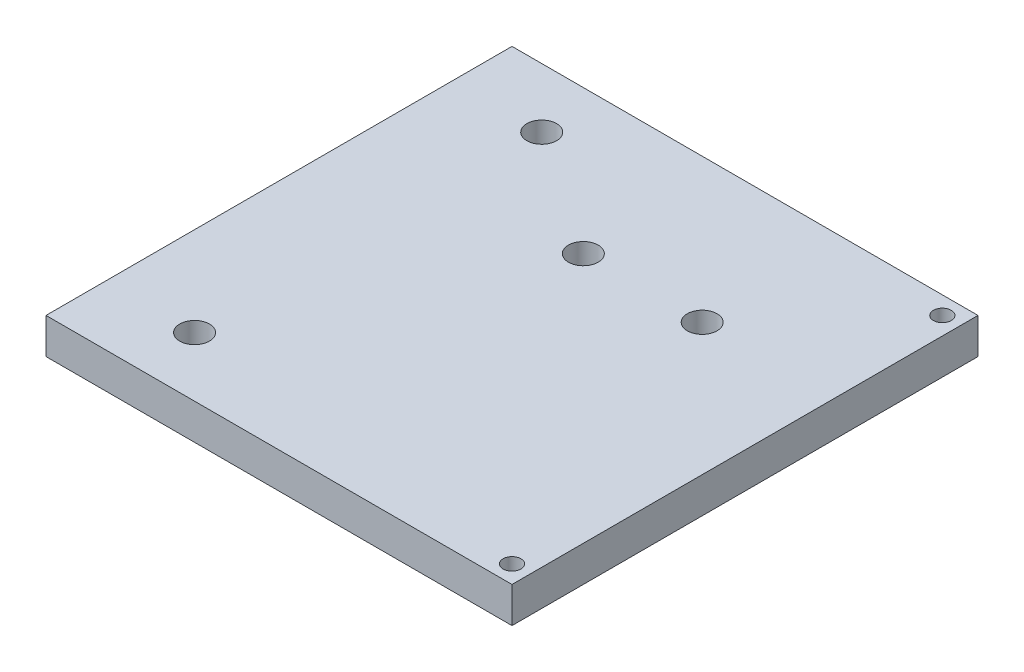
ISO-10303-21;
HEADER;
FILE_DESCRIPTION(('STEP AP214'),'2;1');
FILE_NAME('part.step','',(''),(''),'','','');
FILE_SCHEMA(('AUTOMOTIVE_DESIGN { 1 0 10303 214 1 1 1 1 }'));
ENDSEC;
DATA;
#1=APPLICATION_CONTEXT('core data for automotive mechanical design processes');
#2=APPLICATION_PROTOCOL_DEFINITION('international standard','automotive_design',2000,#1);
#3=PRODUCT_CONTEXT('',#1,'mechanical');
#4=PRODUCT('Part','Part','',(#3));
#5=PRODUCT_RELATED_PRODUCT_CATEGORY('part','',(#4));
#6=PRODUCT_DEFINITION_FORMATION('','',#4);
#7=PRODUCT_DEFINITION_CONTEXT('part definition',#1,'design');
#8=PRODUCT_DEFINITION('design','',#6,#7);
#9=PRODUCT_DEFINITION_SHAPE('','',#8);
#10=(LENGTH_UNIT() NAMED_UNIT(*) SI_UNIT(.MILLI.,.METRE.));
#11=(NAMED_UNIT(*) PLANE_ANGLE_UNIT() SI_UNIT($,.RADIAN.));
#12=(NAMED_UNIT(*) SI_UNIT($,.STERADIAN.) SOLID_ANGLE_UNIT());
#13=UNCERTAINTY_MEASURE_WITH_UNIT(LENGTH_MEASURE(1.E-05),#10,'distance_accuracy_value','');
#14=(GEOMETRIC_REPRESENTATION_CONTEXT(3) GLOBAL_UNCERTAINTY_ASSIGNED_CONTEXT((#13)) GLOBAL_UNIT_ASSIGNED_CONTEXT((#10,
#11,#12)) REPRESENTATION_CONTEXT('',''));
#15=CARTESIAN_POINT('',(0.,0.,0.));
#16=DIRECTION('',(0.,0.,1.));
#17=DIRECTION('',(1.,0.,0.));
#18=AXIS2_PLACEMENT_3D('',#15,#16,#17);
#19=CARTESIAN_POINT('',(0.,6.,0.));
#20=DIRECTION('',(0.,-1.,0.));
#21=DIRECTION('',(0.,0.,-1.));
#22=AXIS2_PLACEMENT_3D('',#19,#20,#21);
#23=PLANE('',#22);
#24=DIRECTION('',(0.,0.,-1.));
#25=VECTOR('',#24,1.);
#26=CARTESIAN_POINT('',(39.2,6.,39.2));
#27=LINE('',#26,#25);
#28=CARTESIAN_POINT('',(39.2,6.,39.2));
#29=VERTEX_POINT('',#28);
#30=CARTESIAN_POINT('',(39.2,6.,-39.2));
#31=VERTEX_POINT('',#30);
#32=EDGE_CURVE('E86',#29,#31,#27,.T.);
#33=ORIENTED_EDGE('',*,*,#32,.T.);
#34=DIRECTION('',(-1.,0.,0.));
#35=VECTOR('',#34,1.);
#36=CARTESIAN_POINT('',(-39.2,6.,-39.2));
#37=LINE('',#36,#35);
#38=CARTESIAN_POINT('',(-39.2,6.,-39.2));
#39=VERTEX_POINT('',#38);
#40=EDGE_CURVE('E81',#31,#39,#37,.T.);
#41=ORIENTED_EDGE('',*,*,#40,.T.);
#42=DIRECTION('',(0.,0.,1.));
#43=VECTOR('',#42,1.);
#44=CARTESIAN_POINT('',(-39.2,6.,39.2));
#45=LINE('',#44,#43);
#46=CARTESIAN_POINT('',(-39.2,6.,39.2));
#47=VERTEX_POINT('',#46);
#48=EDGE_CURVE('E84',#39,#47,#45,.T.);
#49=ORIENTED_EDGE('',*,*,#48,.T.);
#50=DIRECTION('',(1.,0.,0.));
#51=VECTOR('',#50,1.);
#52=CARTESIAN_POINT('',(-39.2,6.,39.2));
#53=LINE('',#52,#51);
#54=EDGE_CURVE('E51',#47,#29,#53,.T.);
#55=ORIENTED_EDGE('',*,*,#54,.T.);
#56=EDGE_LOOP('',(#33,#41,#49,#55));
#57=FACE_BOUND('',#56,.T.);
#58=CARTESIAN_POINT('',(-24.2,6.,-29.2));
#59=DIRECTION('',(0.,1.,0.));
#60=DIRECTION('',(0.,0.,1.));
#61=AXIS2_PLACEMENT_3D('',#58,#59,#60);
#62=CIRCLE('',#61,2.5);
#63=CARTESIAN_POINT('',(-24.2,6.,-26.7));
#64=VERTEX_POINT('',#63);
#65=EDGE_CURVE('E101',#64,#64,#62,.T.);
#66=ORIENTED_EDGE('',*,*,#65,.F.);
#67=EDGE_LOOP('',(#66));
#68=FACE_BOUND('',#67,.T.);
#69=CARTESIAN_POINT('',(-24.2,6.,29.2));
#70=DIRECTION('',(0.,1.,0.));
#71=DIRECTION('',(0.,0.,1.));
#72=AXIS2_PLACEMENT_3D('',#69,#70,#71);
#73=CIRCLE('',#72,2.5);
#74=CARTESIAN_POINT('',(-24.2,6.,31.7));
#75=VERTEX_POINT('',#74);
#76=EDGE_CURVE('E116',#75,#75,#73,.T.);
#77=ORIENTED_EDGE('',*,*,#76,.F.);
#78=EDGE_LOOP('',(#77));
#79=FACE_BOUND('',#78,.T.);
#80=CARTESIAN_POINT('',(36.2,6.,-36.2));
#81=DIRECTION('',(0.,1.,0.));
#82=DIRECTION('',(0.,0.,1.));
#83=AXIS2_PLACEMENT_3D('',#80,#81,#82);
#84=CIRCLE('',#83,1.5);
#85=CARTESIAN_POINT('',(36.2,6.,-34.7));
#86=VERTEX_POINT('',#85);
#87=EDGE_CURVE('E122',#86,#86,#84,.T.);
#88=ORIENTED_EDGE('',*,*,#87,.F.);
#89=EDGE_LOOP('',(#88));
#90=FACE_BOUND('',#89,.T.);
#91=CARTESIAN_POINT('',(36.2,6.,36.2));
#92=DIRECTION('',(0.,1.,0.));
#93=DIRECTION('',(0.,0.,1.));
#94=AXIS2_PLACEMENT_3D('',#91,#92,#93);
#95=CIRCLE('',#94,1.5);
#96=CARTESIAN_POINT('',(36.2,6.,37.7));
#97=VERTEX_POINT('',#96);
#98=EDGE_CURVE('E128',#97,#97,#95,.T.);
#99=ORIENTED_EDGE('',*,*,#98,.F.);
#100=EDGE_LOOP('',(#99));
#101=FACE_BOUND('',#100,.T.);
#102=CARTESIAN_POINT('',(-3.,6.,-15.));
#103=DIRECTION('',(0.,1.,0.));
#104=DIRECTION('',(0.,0.,1.));
#105=AXIS2_PLACEMENT_3D('',#102,#103,#104);
#106=CIRCLE('',#105,2.5);
#107=CARTESIAN_POINT('',(-3.,6.,-12.5));
#108=VERTEX_POINT('',#107);
#109=EDGE_CURVE('E134',#108,#108,#106,.T.);
#110=ORIENTED_EDGE('',*,*,#109,.F.);
#111=EDGE_LOOP('',(#110));
#112=FACE_BOUND('',#111,.T.);
#113=CARTESIAN_POINT('',(17.,6.,-15.));
#114=DIRECTION('',(0.,1.,0.));
#115=DIRECTION('',(0.,0.,1.));
#116=AXIS2_PLACEMENT_3D('',#113,#114,#115);
#117=CIRCLE('',#116,2.5);
#118=CARTESIAN_POINT('',(17.,6.,-12.5));
#119=VERTEX_POINT('',#118);
#120=EDGE_CURVE('E140',#119,#119,#117,.T.);
#121=ORIENTED_EDGE('',*,*,#120,.F.);
#122=EDGE_LOOP('',(#121));
#123=FACE_BOUND('',#122,.T.);
#124=ADVANCED_FACE('F34',(#57,#68,#79,#90,#101,#112,#123),#23,.F.);
#125=CARTESIAN_POINT('',(0.,0.,0.));
#126=DIRECTION('',(0.,-1.,0.));
#127=DIRECTION('',(0.,0.,-1.));
#128=AXIS2_PLACEMENT_3D('',#125,#126,#127);
#129=PLANE('',#128);
#130=CARTESIAN_POINT('',(-3.,0.,-15.));
#131=DIRECTION('',(0.,1.,0.));
#132=DIRECTION('',(0.,0.,1.));
#133=AXIS2_PLACEMENT_3D('',#130,#131,#132);
#134=CIRCLE('',#133,2.5);
#135=CARTESIAN_POINT('',(-3.,0.,-12.5));
#136=VERTEX_POINT('',#135);
#137=EDGE_CURVE('E137',#136,#136,#134,.T.);
#138=ORIENTED_EDGE('',*,*,#137,.T.);
#139=EDGE_LOOP('',(#138));
#140=FACE_BOUND('',#139,.T.);
#141=CARTESIAN_POINT('',(36.2,0.,-36.2));
#142=DIRECTION('',(0.,1.,0.));
#143=DIRECTION('',(0.,0.,1.));
#144=AXIS2_PLACEMENT_3D('',#141,#142,#143);
#145=CIRCLE('',#144,1.5);
#146=CARTESIAN_POINT('',(36.2,0.,-34.7));
#147=VERTEX_POINT('',#146);
#148=EDGE_CURVE('E125',#147,#147,#145,.T.);
#149=ORIENTED_EDGE('',*,*,#148,.T.);
#150=EDGE_LOOP('',(#149));
#151=FACE_BOUND('',#150,.T.);
#152=CARTESIAN_POINT('',(-24.2,0.,-29.2));
#153=DIRECTION('',(0.,1.,0.));
#154=DIRECTION('',(0.,0.,1.));
#155=AXIS2_PLACEMENT_3D('',#152,#153,#154);
#156=CIRCLE('',#155,2.5);
#157=CARTESIAN_POINT('',(-24.2,0.,-26.7));
#158=VERTEX_POINT('',#157);
#159=EDGE_CURVE('E113',#158,#158,#156,.T.);
#160=ORIENTED_EDGE('',*,*,#159,.T.);
#161=EDGE_LOOP('',(#160));
#162=FACE_BOUND('',#161,.T.);
#163=DIRECTION('',(0.,0.,-1.));
#164=VECTOR('',#163,1.);
#165=CARTESIAN_POINT('',(39.2,0.,39.2));
#166=LINE('',#165,#164);
#167=CARTESIAN_POINT('',(39.2,0.,39.2));
#168=VERTEX_POINT('',#167);
#169=CARTESIAN_POINT('',(39.2,0.,-39.2));
#170=VERTEX_POINT('',#169);
#171=EDGE_CURVE('E98',#168,#170,#166,.T.);
#172=ORIENTED_EDGE('',*,*,#171,.F.);
#173=DIRECTION('',(1.,0.,0.));
#174=VECTOR('',#173,1.);
#175=CARTESIAN_POINT('',(-39.2,0.,39.2));
#176=LINE('',#175,#174);
#177=CARTESIAN_POINT('',(-39.2,0.,39.2));
#178=VERTEX_POINT('',#177);
#179=EDGE_CURVE('E74',#178,#168,#176,.T.);
#180=ORIENTED_EDGE('',*,*,#179,.F.);
#181=DIRECTION('',(0.,0.,1.));
#182=VECTOR('',#181,1.);
#183=CARTESIAN_POINT('',(-39.2,0.,39.2));
#184=LINE('',#183,#182);
#185=CARTESIAN_POINT('',(-39.2,0.,-39.2));
#186=VERTEX_POINT('',#185);
#187=EDGE_CURVE('E68',#186,#178,#184,.T.);
#188=ORIENTED_EDGE('',*,*,#187,.F.);
#189=DIRECTION('',(-1.,0.,0.));
#190=VECTOR('',#189,1.);
#191=CARTESIAN_POINT('',(-39.2,0.,-39.2));
#192=LINE('',#191,#190);
#193=EDGE_CURVE('E90',#170,#186,#192,.T.);
#194=ORIENTED_EDGE('',*,*,#193,.F.);
#195=EDGE_LOOP('',(#172,#180,#188,#194));
#196=FACE_BOUND('',#195,.T.);
#197=CARTESIAN_POINT('',(-24.2,0.,29.2));
#198=DIRECTION('',(0.,1.,0.));
#199=DIRECTION('',(0.,0.,1.));
#200=AXIS2_PLACEMENT_3D('',#197,#198,#199);
#201=CIRCLE('',#200,2.5);
#202=CARTESIAN_POINT('',(-24.2,0.,31.7));
#203=VERTEX_POINT('',#202);
#204=EDGE_CURVE('E119',#203,#203,#201,.T.);
#205=ORIENTED_EDGE('',*,*,#204,.T.);
#206=EDGE_LOOP('',(#205));
#207=FACE_BOUND('',#206,.T.);
#208=CARTESIAN_POINT('',(36.2,0.,36.2));
#209=DIRECTION('',(0.,1.,0.));
#210=DIRECTION('',(0.,0.,1.));
#211=AXIS2_PLACEMENT_3D('',#208,#209,#210);
#212=CIRCLE('',#211,1.5);
#213=CARTESIAN_POINT('',(36.2,0.,37.7));
#214=VERTEX_POINT('',#213);
#215=EDGE_CURVE('E131',#214,#214,#212,.T.);
#216=ORIENTED_EDGE('',*,*,#215,.T.);
#217=EDGE_LOOP('',(#216));
#218=FACE_BOUND('',#217,.T.);
#219=CARTESIAN_POINT('',(17.,0.,-15.));
#220=DIRECTION('',(0.,1.,0.));
#221=DIRECTION('',(0.,0.,1.));
#222=AXIS2_PLACEMENT_3D('',#219,#220,#221);
#223=CIRCLE('',#222,2.5);
#224=CARTESIAN_POINT('',(17.,0.,-12.5));
#225=VERTEX_POINT('',#224);
#226=EDGE_CURVE('E143',#225,#225,#223,.T.);
#227=ORIENTED_EDGE('',*,*,#226,.T.);
#228=EDGE_LOOP('',(#227));
#229=FACE_BOUND('',#228,.T.);
#230=ADVANCED_FACE('F109',(#140,#151,#162,#196,#207,#218,#229),#129,.T.);
#231=CARTESIAN_POINT('',(39.2,6.,39.2));
#232=DIRECTION('',(-1.,0.,0.));
#233=DIRECTION('',(0.,0.,1.));
#234=AXIS2_PLACEMENT_3D('',#231,#232,#233);
#235=PLANE('',#234);
#236=ORIENTED_EDGE('',*,*,#171,.T.);
#237=DIRECTION('',(0.,-1.,0.));
#238=VECTOR('',#237,1.);
#239=CARTESIAN_POINT('',(39.2,6.,-39.2));
#240=LINE('',#239,#238);
#241=EDGE_CURVE('E11',#31,#170,#240,.T.);
#242=ORIENTED_EDGE('',*,*,#241,.F.);
#243=ORIENTED_EDGE('',*,*,#32,.F.);
#244=DIRECTION('',(0.,-1.,0.));
#245=VECTOR('',#244,1.);
#246=CARTESIAN_POINT('',(39.2,6.,39.2));
#247=LINE('',#246,#245);
#248=EDGE_CURVE('E94',#29,#168,#247,.T.);
#249=ORIENTED_EDGE('',*,*,#248,.T.);
#250=EDGE_LOOP('',(#236,#242,#243,#249));
#251=FACE_BOUND('',#250,.T.);
#252=ADVANCED_FACE('F36',(#251),#235,.F.);
#253=CARTESIAN_POINT('',(-39.2,6.,-39.2));
#254=DIRECTION('',(0.,0.,1.));
#255=DIRECTION('',(1.,0.,0.));
#256=AXIS2_PLACEMENT_3D('',#253,#254,#255);
#257=PLANE('',#256);
#258=ORIENTED_EDGE('',*,*,#193,.T.);
#259=DIRECTION('',(0.,-1.,0.));
#260=VECTOR('',#259,1.);
#261=CARTESIAN_POINT('',(-39.2,6.,-39.2));
#262=LINE('',#261,#260);
#263=EDGE_CURVE('E43',#39,#186,#262,.T.);
#264=ORIENTED_EDGE('',*,*,#263,.F.);
#265=ORIENTED_EDGE('',*,*,#40,.F.);
#266=ORIENTED_EDGE('',*,*,#241,.T.);
#267=EDGE_LOOP('',(#258,#264,#265,#266));
#268=FACE_BOUND('',#267,.T.);
#269=ADVANCED_FACE('F89',(#268),#257,.F.);
#270=CARTESIAN_POINT('',(-39.2,6.,39.2));
#271=DIRECTION('',(1.,0.,0.));
#272=DIRECTION('',(0.,0.,-1.));
#273=AXIS2_PLACEMENT_3D('',#270,#271,#272);
#274=PLANE('',#273);
#275=ORIENTED_EDGE('',*,*,#187,.T.);
#276=DIRECTION('',(0.,-1.,0.));
#277=VECTOR('',#276,1.);
#278=CARTESIAN_POINT('',(-39.2,6.,39.2));
#279=LINE('',#278,#277);
#280=EDGE_CURVE('E91',#47,#178,#279,.T.);
#281=ORIENTED_EDGE('',*,*,#280,.F.);
#282=ORIENTED_EDGE('',*,*,#48,.F.);
#283=ORIENTED_EDGE('',*,*,#263,.T.);
#284=EDGE_LOOP('',(#275,#281,#282,#283));
#285=FACE_BOUND('',#284,.T.);
#286=ADVANCED_FACE('F92',(#285),#274,.F.);
#287=CARTESIAN_POINT('',(-39.2,6.,39.2));
#288=DIRECTION('',(0.,0.,-1.));
#289=DIRECTION('',(-1.,0.,0.));
#290=AXIS2_PLACEMENT_3D('',#287,#288,#289);
#291=PLANE('',#290);
#292=ORIENTED_EDGE('',*,*,#179,.T.);
#293=ORIENTED_EDGE('',*,*,#248,.F.);
#294=ORIENTED_EDGE('',*,*,#54,.F.);
#295=ORIENTED_EDGE('',*,*,#280,.T.);
#296=EDGE_LOOP('',(#292,#293,#294,#295));
#297=FACE_BOUND('',#296,.T.);
#298=ADVANCED_FACE('F106',(#297),#291,.F.);
#299=CARTESIAN_POINT('',(-24.2,6.,-29.2));
#300=DIRECTION('',(0.,-1.,0.));
#301=DIRECTION('',(0.,0.,-1.));
#302=AXIS2_PLACEMENT_3D('',#299,#300,#301);
#303=CYLINDRICAL_SURFACE('',#302,2.5);
#304=ORIENTED_EDGE('',*,*,#65,.T.);
#305=EDGE_LOOP('',(#304));
#306=FACE_BOUND('',#305,.T.);
#307=ORIENTED_EDGE('',*,*,#159,.F.);
#308=EDGE_LOOP('',(#307));
#309=FACE_BOUND('',#308,.T.);
#310=ADVANCED_FACE('F160',(#306,#309),#303,.F.);
#311=CARTESIAN_POINT('',(-24.2,6.,29.2));
#312=DIRECTION('',(0.,-1.,0.));
#313=DIRECTION('',(0.,0.,-1.));
#314=AXIS2_PLACEMENT_3D('',#311,#312,#313);
#315=CYLINDRICAL_SURFACE('',#314,2.5);
#316=ORIENTED_EDGE('',*,*,#76,.T.);
#317=EDGE_LOOP('',(#316));
#318=FACE_BOUND('',#317,.T.);
#319=ORIENTED_EDGE('',*,*,#204,.F.);
#320=EDGE_LOOP('',(#319));
#321=FACE_BOUND('',#320,.T.);
#322=ADVANCED_FACE('F206',(#318,#321),#315,.F.);
#323=CARTESIAN_POINT('',(36.2,6.,-36.2));
#324=DIRECTION('',(0.,-1.,0.));
#325=DIRECTION('',(0.,0.,-1.));
#326=AXIS2_PLACEMENT_3D('',#323,#324,#325);
#327=CYLINDRICAL_SURFACE('',#326,1.5);
#328=ORIENTED_EDGE('',*,*,#87,.T.);
#329=EDGE_LOOP('',(#328));
#330=FACE_BOUND('',#329,.T.);
#331=ORIENTED_EDGE('',*,*,#148,.F.);
#332=EDGE_LOOP('',(#331));
#333=FACE_BOUND('',#332,.T.);
#334=ADVANCED_FACE('F214',(#330,#333),#327,.F.);
#335=CARTESIAN_POINT('',(36.2,6.,36.2));
#336=DIRECTION('',(0.,-1.,0.));
#337=DIRECTION('',(0.,0.,-1.));
#338=AXIS2_PLACEMENT_3D('',#335,#336,#337);
#339=CYLINDRICAL_SURFACE('',#338,1.5);
#340=ORIENTED_EDGE('',*,*,#98,.T.);
#341=EDGE_LOOP('',(#340));
#342=FACE_BOUND('',#341,.T.);
#343=ORIENTED_EDGE('',*,*,#215,.F.);
#344=EDGE_LOOP('',(#343));
#345=FACE_BOUND('',#344,.T.);
#346=ADVANCED_FACE('F222',(#342,#345),#339,.F.);
#347=CARTESIAN_POINT('',(-3.,6.,-15.));
#348=DIRECTION('',(0.,-1.,0.));
#349=DIRECTION('',(0.,0.,-1.));
#350=AXIS2_PLACEMENT_3D('',#347,#348,#349);
#351=CYLINDRICAL_SURFACE('',#350,2.5);
#352=ORIENTED_EDGE('',*,*,#109,.T.);
#353=EDGE_LOOP('',(#352));
#354=FACE_BOUND('',#353,.T.);
#355=ORIENTED_EDGE('',*,*,#137,.F.);
#356=EDGE_LOOP('',(#355));
#357=FACE_BOUND('',#356,.T.);
#358=ADVANCED_FACE('F231',(#354,#357),#351,.F.);
#359=CARTESIAN_POINT('',(17.,6.,-15.));
#360=DIRECTION('',(0.,-1.,0.));
#361=DIRECTION('',(0.,0.,-1.));
#362=AXIS2_PLACEMENT_3D('',#359,#360,#361);
#363=CYLINDRICAL_SURFACE('',#362,2.5);
#364=ORIENTED_EDGE('',*,*,#120,.T.);
#365=EDGE_LOOP('',(#364));
#366=FACE_BOUND('',#365,.T.);
#367=ORIENTED_EDGE('',*,*,#226,.F.);
#368=EDGE_LOOP('',(#367));
#369=FACE_BOUND('',#368,.T.);
#370=ADVANCED_FACE('F149',(#366,#369),#363,.F.);
#371=CLOSED_SHELL('',(#124,#230,#252,#269,#286,#298,#310,#322,#334,#346,#358,#370));
#372=MANIFOLD_SOLID_BREP('B2',#371);
#373=ADVANCED_BREP_SHAPE_REPRESENTATION('',(#18,#372),#14);
#374=SHAPE_DEFINITION_REPRESENTATION(#9,#373);
ENDSEC;
END-ISO-10303-21;
